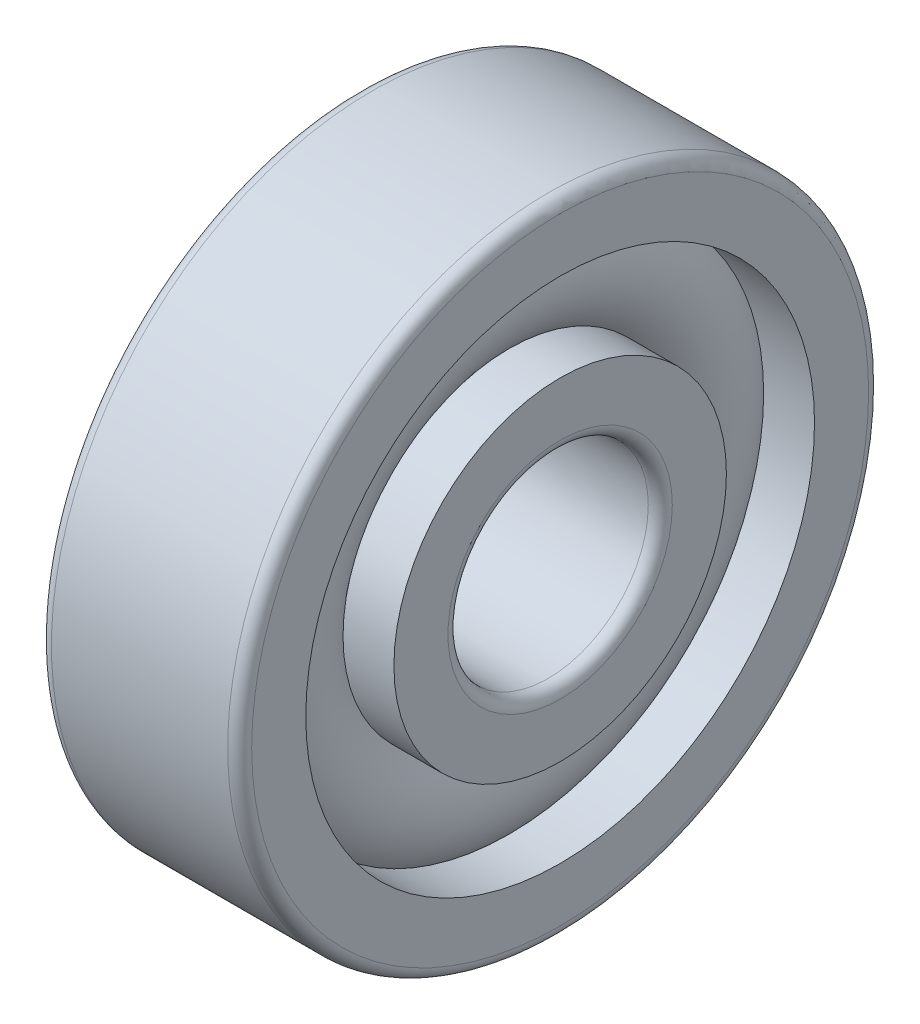
ISO-10303-21;
HEADER;
FILE_DESCRIPTION(('STEP AP214'),'2;1');
FILE_NAME('part.step','',(''),(''),'','','');
FILE_SCHEMA(('AUTOMOTIVE_DESIGN { 1 0 10303 214 1 1 1 1 }'));
ENDSEC;
DATA;
#1=APPLICATION_CONTEXT('core data for automotive mechanical design processes');
#2=APPLICATION_PROTOCOL_DEFINITION('international standard','automotive_design',2000,#1);
#3=PRODUCT_CONTEXT('',#1,'mechanical');
#4=PRODUCT('Part','Part','',(#3));
#5=PRODUCT_RELATED_PRODUCT_CATEGORY('part','',(#4));
#6=PRODUCT_DEFINITION_FORMATION('','',#4);
#7=PRODUCT_DEFINITION_CONTEXT('part definition',#1,'design');
#8=PRODUCT_DEFINITION('design','',#6,#7);
#9=PRODUCT_DEFINITION_SHAPE('','',#8);
#10=(LENGTH_UNIT() NAMED_UNIT(*) SI_UNIT(.MILLI.,.METRE.));
#11=(NAMED_UNIT(*) PLANE_ANGLE_UNIT() SI_UNIT($,.RADIAN.));
#12=(NAMED_UNIT(*) SI_UNIT($,.STERADIAN.) SOLID_ANGLE_UNIT());
#13=UNCERTAINTY_MEASURE_WITH_UNIT(LENGTH_MEASURE(1.E-05),#10,'distance_accuracy_value','');
#14=(GEOMETRIC_REPRESENTATION_CONTEXT(3) GLOBAL_UNCERTAINTY_ASSIGNED_CONTEXT((#13)) GLOBAL_UNIT_ASSIGNED_CONTEXT((#10,
#11,#12)) REPRESENTATION_CONTEXT('',''));
#15=CARTESIAN_POINT('',(0.,0.,0.));
#16=DIRECTION('',(0.,0.,1.));
#17=DIRECTION('',(1.,0.,0.));
#18=AXIS2_PLACEMENT_3D('',#15,#16,#17);
#19=CARTESIAN_POINT('',(0.,0.,0.));
#20=DIRECTION('',(-1.,0.,0.));
#21=DIRECTION('',(0.,0.,1.));
#22=AXIS2_PLACEMENT_3D('',#19,#20,#21);
#23=TOROIDAL_SURFACE('',#22,5.25,1.65);
#24=CARTESIAN_POINT('',(1.22983738762488,0.,0.));
#25=DIRECTION('',(-1.,0.,0.));
#26=DIRECTION('',(0.,0.,1.));
#27=AXIS2_PLACEMENT_3D('',#24,#25,#26);
#28=CIRCLE('',#27,6.35);
#29=CARTESIAN_POINT('',(1.22983738762488,0.,6.35));
#30=VERTEX_POINT('',#29);
#31=EDGE_CURVE('E17',#30,#30,#28,.F.);
#32=ORIENTED_EDGE('',*,*,#31,.T.);
#33=EDGE_LOOP('',(#32));
#34=FACE_BOUND('',#33,.T.);
#35=CARTESIAN_POINT('',(1.22983738762488,0.,0.));
#36=DIRECTION('',(-1.,0.,0.));
#37=DIRECTION('',(0.,0.,1.));
#38=AXIS2_PLACEMENT_3D('',#35,#36,#37);
#39=CIRCLE('',#38,4.15);
#40=CARTESIAN_POINT('',(1.22983738762488,0.,4.15));
#41=VERTEX_POINT('',#40);
#42=EDGE_CURVE('E9',#41,#41,#39,.T.);
#43=ORIENTED_EDGE('',*,*,#42,.T.);
#44=EDGE_LOOP('',(#43));
#45=FACE_BOUND('',#44,.T.);
#46=ADVANCED_FACE('F13',(#34,#45),#23,.T.);
#47=CARTESIAN_POINT('',(-20.6375,0.,0.));
#48=DIRECTION('',(1.,0.,0.));
#49=DIRECTION('',(0.,0.,-1.));
#50=AXIS2_PLACEMENT_3D('',#47,#48,#49);
#51=CYLINDRICAL_SURFACE('',#50,4.15);
#52=CARTESIAN_POINT('',(2.5,0.,0.));
#53=DIRECTION('',(1.,0.,0.));
#54=DIRECTION('',(0.,0.,-1.));
#55=AXIS2_PLACEMENT_3D('',#52,#53,#54);
#56=CIRCLE('',#55,4.15);
#57=CARTESIAN_POINT('',(2.5,0.,-4.15));
#58=VERTEX_POINT('',#57);
#59=EDGE_CURVE('E26',#58,#58,#56,.T.);
#60=ORIENTED_EDGE('',*,*,#59,.F.);
#61=EDGE_LOOP('',(#60));
#62=FACE_BOUND('',#61,.T.);
#63=ORIENTED_EDGE('',*,*,#42,.F.);
#64=EDGE_LOOP('',(#63));
#65=FACE_BOUND('',#64,.T.);
#66=ADVANCED_FACE('F65',(#62,#65),#51,.T.);
#67=CARTESIAN_POINT('',(-20.6375,0.,0.));
#68=DIRECTION('',(1.,0.,0.));
#69=DIRECTION('',(0.,0.,-1.));
#70=AXIS2_PLACEMENT_3D('',#67,#68,#69);
#71=CYLINDRICAL_SURFACE('',#70,4.15);
#72=CARTESIAN_POINT('',(-2.5,0.,0.));
#73=DIRECTION('',(1.,0.,0.));
#74=DIRECTION('',(0.,0.,-1.));
#75=AXIS2_PLACEMENT_3D('',#72,#73,#74);
#76=CIRCLE('',#75,4.15);
#77=CARTESIAN_POINT('',(-2.5,0.,-4.15));
#78=VERTEX_POINT('',#77);
#79=EDGE_CURVE('E35',#78,#78,#76,.T.);
#80=ORIENTED_EDGE('',*,*,#79,.T.);
#81=EDGE_LOOP('',(#80));
#82=FACE_BOUND('',#81,.T.);
#83=CARTESIAN_POINT('',(-1.22983738762488,0.,0.));
#84=DIRECTION('',(1.,0.,0.));
#85=DIRECTION('',(0.,0.,-1.));
#86=AXIS2_PLACEMENT_3D('',#83,#84,#85);
#87=CIRCLE('',#86,4.15);
#88=CARTESIAN_POINT('',(-1.22983738762488,0.,-4.15));
#89=VERTEX_POINT('',#88);
#90=EDGE_CURVE('E21',#89,#89,#87,.T.);
#91=ORIENTED_EDGE('',*,*,#90,.F.);
#92=EDGE_LOOP('',(#91));
#93=FACE_BOUND('',#92,.T.);
#94=ADVANCED_FACE('F68',(#82,#93),#71,.T.);
#95=CARTESIAN_POINT('',(2.5,2.8,0.));
#96=DIRECTION('',(1.,0.,0.));
#97=DIRECTION('',(0.,0.,-1.));
#98=AXIS2_PLACEMENT_3D('',#95,#96,#97);
#99=PLANE('',#98);
#100=ORIENTED_EDGE('',*,*,#59,.T.);
#101=EDGE_LOOP('',(#100));
#102=FACE_BOUND('',#101,.T.);
#103=CARTESIAN_POINT('',(2.5,0.,0.));
#104=DIRECTION('',(1.,0.,0.));
#105=DIRECTION('',(0.,0.,-1.));
#106=AXIS2_PLACEMENT_3D('',#103,#104,#105);
#107=CIRCLE('',#106,2.8);
#108=CARTESIAN_POINT('',(2.5,0.,-2.8));
#109=VERTEX_POINT('',#108);
#110=EDGE_CURVE('E57',#109,#109,#107,.T.);
#111=ORIENTED_EDGE('',*,*,#110,.F.);
#112=EDGE_LOOP('',(#111));
#113=FACE_BOUND('',#112,.T.);
#114=ADVANCED_FACE('F62',(#102,#113),#99,.T.);
#115=CARTESIAN_POINT('',(2.2,0.,0.));
#116=DIRECTION('',(1.,0.,0.));
#117=DIRECTION('',(0.,0.,-1.));
#118=AXIS2_PLACEMENT_3D('',#115,#116,#117);
#119=TOROIDAL_SURFACE('',#118,2.8,0.3);
#120=ORIENTED_EDGE('',*,*,#110,.T.);
#121=EDGE_LOOP('',(#120));
#122=FACE_BOUND('',#121,.T.);
#123=CARTESIAN_POINT('',(2.2,0.,0.));
#124=DIRECTION('',(1.,0.,0.));
#125=DIRECTION('',(0.,0.,-1.));
#126=AXIS2_PLACEMENT_3D('',#123,#124,#125);
#127=CIRCLE('',#126,2.5);
#128=CARTESIAN_POINT('',(2.2,0.,-2.5));
#129=VERTEX_POINT('',#128);
#130=EDGE_CURVE('E54',#129,#129,#127,.T.);
#131=ORIENTED_EDGE('',*,*,#130,.F.);
#132=EDGE_LOOP('',(#131));
#133=FACE_BOUND('',#132,.T.);
#134=ADVANCED_FACE('F81',(#122,#133),#119,.T.);
#135=CARTESIAN_POINT('',(-20.6375,0.,0.));
#136=DIRECTION('',(1.,0.,0.));
#137=DIRECTION('',(0.,0.,-1.));
#138=AXIS2_PLACEMENT_3D('',#135,#136,#137);
#139=CYLINDRICAL_SURFACE('',#138,2.5);
#140=ORIENTED_EDGE('',*,*,#130,.T.);
#141=EDGE_LOOP('',(#140));
#142=FACE_BOUND('',#141,.T.);
#143=CARTESIAN_POINT('',(-2.2,0.,0.));
#144=DIRECTION('',(1.,0.,0.));
#145=DIRECTION('',(0.,0.,-1.));
#146=AXIS2_PLACEMENT_3D('',#143,#144,#145);
#147=CIRCLE('',#146,2.5);
#148=CARTESIAN_POINT('',(-2.2,0.,-2.5));
#149=VERTEX_POINT('',#148);
#150=EDGE_CURVE('E51',#149,#149,#147,.T.);
#151=ORIENTED_EDGE('',*,*,#150,.F.);
#152=EDGE_LOOP('',(#151));
#153=FACE_BOUND('',#152,.T.);
#154=ADVANCED_FACE('F84',(#142,#153),#139,.F.);
#155=CARTESIAN_POINT('',(-2.2,0.,0.));
#156=DIRECTION('',(1.,0.,0.));
#157=DIRECTION('',(0.,0.,-1.));
#158=AXIS2_PLACEMENT_3D('',#155,#156,#157);
#159=TOROIDAL_SURFACE('',#158,2.8,0.3);
#160=ORIENTED_EDGE('',*,*,#150,.T.);
#161=EDGE_LOOP('',(#160));
#162=FACE_BOUND('',#161,.T.);
#163=CARTESIAN_POINT('',(-2.5,0.,0.));
#164=DIRECTION('',(1.,0.,0.));
#165=DIRECTION('',(0.,0.,-1.));
#166=AXIS2_PLACEMENT_3D('',#163,#164,#165);
#167=CIRCLE('',#166,2.8);
#168=CARTESIAN_POINT('',(-2.5,0.,-2.8));
#169=VERTEX_POINT('',#168);
#170=EDGE_CURVE('E48',#169,#169,#167,.T.);
#171=ORIENTED_EDGE('',*,*,#170,.F.);
#172=EDGE_LOOP('',(#171));
#173=FACE_BOUND('',#172,.T.);
#174=ADVANCED_FACE('F88',(#162,#173),#159,.T.);
#175=CARTESIAN_POINT('',(-2.5,4.15,0.));
#176=DIRECTION('',(-1.,0.,0.));
#177=DIRECTION('',(0.,0.,1.));
#178=AXIS2_PLACEMENT_3D('',#175,#176,#177);
#179=PLANE('',#178);
#180=ORIENTED_EDGE('',*,*,#170,.T.);
#181=EDGE_LOOP('',(#180));
#182=FACE_BOUND('',#181,.T.);
#183=ORIENTED_EDGE('',*,*,#79,.F.);
#184=EDGE_LOOP('',(#183));
#185=FACE_BOUND('',#184,.T.);
#186=ADVANCED_FACE('F92',(#182,#185),#179,.T.);
#187=CARTESIAN_POINT('',(-1.22983738762488,0.,0.));
#188=DIRECTION('',(1.,0.,0.));
#189=DIRECTION('',(0.,0.,-1.));
#190=AXIS2_PLACEMENT_3D('',#187,#188,#189);
#191=CIRCLE('',#190,6.35);
#192=CARTESIAN_POINT('',(-1.22983738762488,0.,-6.35));
#193=VERTEX_POINT('',#192);
#194=EDGE_CURVE('E29',#193,#193,#191,.F.);
#195=ORIENTED_EDGE('',*,*,#194,.T.);
#196=EDGE_LOOP('',(#195));
#197=FACE_BOUND('',#196,.T.);
#198=ORIENTED_EDGE('',*,*,#90,.T.);
#199=EDGE_LOOP('',(#198));
#200=FACE_BOUND('',#199,.T.);
#201=ADVANCED_FACE('F15',(#197,#200),#23,.T.);
#202=CARTESIAN_POINT('',(-20.6375,0.,0.));
#203=DIRECTION('',(1.,0.,0.));
#204=DIRECTION('',(0.,0.,-1.));
#205=AXIS2_PLACEMENT_3D('',#202,#203,#204);
#206=CYLINDRICAL_SURFACE('',#205,6.35);
#207=CARTESIAN_POINT('',(2.5,0.,0.));
#208=DIRECTION('',(1.,0.,0.));
#209=DIRECTION('',(0.,0.,-1.));
#210=AXIS2_PLACEMENT_3D('',#207,#208,#209);
#211=CIRCLE('',#210,6.35);
#212=CARTESIAN_POINT('',(2.5,0.,-6.35));
#213=VERTEX_POINT('',#212);
#214=EDGE_CURVE('E31',#213,#213,#211,.T.);
#215=ORIENTED_EDGE('',*,*,#214,.T.);
#216=EDGE_LOOP('',(#215));
#217=FACE_BOUND('',#216,.T.);
#218=ORIENTED_EDGE('',*,*,#31,.F.);
#219=EDGE_LOOP('',(#218));
#220=FACE_BOUND('',#219,.T.);
#221=ADVANCED_FACE('F97',(#217,#220),#206,.F.);
#222=CARTESIAN_POINT('',(-20.6375,0.,0.));
#223=DIRECTION('',(1.,0.,0.));
#224=DIRECTION('',(0.,0.,-1.));
#225=AXIS2_PLACEMENT_3D('',#222,#223,#224);
#226=CYLINDRICAL_SURFACE('',#225,6.35);
#227=CARTESIAN_POINT('',(-2.5,0.,0.));
#228=DIRECTION('',(1.,0.,0.));
#229=DIRECTION('',(0.,0.,-1.));
#230=AXIS2_PLACEMENT_3D('',#227,#228,#229);
#231=CIRCLE('',#230,6.35);
#232=CARTESIAN_POINT('',(-2.5,0.,-6.35));
#233=VERTEX_POINT('',#232);
#234=EDGE_CURVE('E129',#233,#233,#231,.T.);
#235=ORIENTED_EDGE('',*,*,#234,.F.);
#236=EDGE_LOOP('',(#235));
#237=FACE_BOUND('',#236,.T.);
#238=ORIENTED_EDGE('',*,*,#194,.F.);
#239=EDGE_LOOP('',(#238));
#240=FACE_BOUND('',#239,.T.);
#241=ADVANCED_FACE('F100',(#237,#240),#226,.F.);
#242=CARTESIAN_POINT('',(2.5,7.7,0.));
#243=DIRECTION('',(1.,0.,0.));
#244=DIRECTION('',(0.,0.,-1.));
#245=AXIS2_PLACEMENT_3D('',#242,#243,#244);
#246=PLANE('',#245);
#247=CARTESIAN_POINT('',(2.5,0.,0.));
#248=DIRECTION('',(1.,0.,0.));
#249=DIRECTION('',(0.,0.,-1.));
#250=AXIS2_PLACEMENT_3D('',#247,#248,#249);
#251=CIRCLE('',#250,7.7);
#252=CARTESIAN_POINT('',(2.5,0.,-7.7));
#253=VERTEX_POINT('',#252);
#254=EDGE_CURVE('E37',#253,#253,#251,.T.);
#255=ORIENTED_EDGE('',*,*,#254,.T.);
#256=EDGE_LOOP('',(#255));
#257=FACE_BOUND('',#256,.T.);
#258=ORIENTED_EDGE('',*,*,#214,.F.);
#259=EDGE_LOOP('',(#258));
#260=FACE_BOUND('',#259,.T.);
#261=ADVANCED_FACE('F101',(#257,#260),#246,.T.);
#262=CARTESIAN_POINT('',(2.2,0.,0.));
#263=DIRECTION('',(1.,0.,0.));
#264=DIRECTION('',(0.,0.,-1.));
#265=AXIS2_PLACEMENT_3D('',#262,#263,#264);
#266=TOROIDAL_SURFACE('',#265,7.7,0.3);
#267=CARTESIAN_POINT('',(2.2,0.,0.));
#268=DIRECTION('',(1.,0.,0.));
#269=DIRECTION('',(0.,0.,-1.));
#270=AXIS2_PLACEMENT_3D('',#267,#268,#269);
#271=CIRCLE('',#270,8.);
#272=CARTESIAN_POINT('',(2.2,0.,-8.));
#273=VERTEX_POINT('',#272);
#274=EDGE_CURVE('E42',#273,#273,#271,.T.);
#275=ORIENTED_EDGE('',*,*,#274,.T.);
#276=EDGE_LOOP('',(#275));
#277=FACE_BOUND('',#276,.T.);
#278=ORIENTED_EDGE('',*,*,#254,.F.);
#279=EDGE_LOOP('',(#278));
#280=FACE_BOUND('',#279,.T.);
#281=ADVANCED_FACE('F104',(#277,#280),#266,.T.);
#282=CARTESIAN_POINT('',(-20.6375,0.,0.));
#283=DIRECTION('',(1.,0.,0.));
#284=DIRECTION('',(0.,0.,-1.));
#285=AXIS2_PLACEMENT_3D('',#282,#283,#284);
#286=CYLINDRICAL_SURFACE('',#285,8.);
#287=CARTESIAN_POINT('',(-2.2,0.,0.));
#288=DIRECTION('',(1.,0.,0.));
#289=DIRECTION('',(0.,0.,-1.));
#290=AXIS2_PLACEMENT_3D('',#287,#288,#289);
#291=CIRCLE('',#290,8.);
#292=CARTESIAN_POINT('',(-2.2,0.,-8.));
#293=VERTEX_POINT('',#292);
#294=EDGE_CURVE('E133',#293,#293,#291,.T.);
#295=ORIENTED_EDGE('',*,*,#294,.T.);
#296=EDGE_LOOP('',(#295));
#297=FACE_BOUND('',#296,.T.);
#298=ORIENTED_EDGE('',*,*,#274,.F.);
#299=EDGE_LOOP('',(#298));
#300=FACE_BOUND('',#299,.T.);
#301=ADVANCED_FACE('F108',(#297,#300),#286,.T.);
#302=CARTESIAN_POINT('',(-2.2,0.,0.));
#303=DIRECTION('',(1.,0.,0.));
#304=DIRECTION('',(0.,0.,-1.));
#305=AXIS2_PLACEMENT_3D('',#302,#303,#304);
#306=TOROIDAL_SURFACE('',#305,7.7,0.3);
#307=CARTESIAN_POINT('',(-2.5,0.,0.));
#308=DIRECTION('',(1.,0.,0.));
#309=DIRECTION('',(0.,0.,-1.));
#310=AXIS2_PLACEMENT_3D('',#307,#308,#309);
#311=CIRCLE('',#310,7.7);
#312=CARTESIAN_POINT('',(-2.5,0.,-7.7));
#313=VERTEX_POINT('',#312);
#314=EDGE_CURVE('E130',#313,#313,#311,.T.);
#315=ORIENTED_EDGE('',*,*,#314,.T.);
#316=EDGE_LOOP('',(#315));
#317=FACE_BOUND('',#316,.T.);
#318=ORIENTED_EDGE('',*,*,#294,.F.);
#319=EDGE_LOOP('',(#318));
#320=FACE_BOUND('',#319,.T.);
#321=ADVANCED_FACE('F112',(#317,#320),#306,.T.);
#322=CARTESIAN_POINT('',(-2.5,6.35,0.));
#323=DIRECTION('',(-1.,0.,0.));
#324=DIRECTION('',(0.,0.,1.));
#325=AXIS2_PLACEMENT_3D('',#322,#323,#324);
#326=PLANE('',#325);
#327=ORIENTED_EDGE('',*,*,#234,.T.);
#328=EDGE_LOOP('',(#327));
#329=FACE_BOUND('',#328,.T.);
#330=ORIENTED_EDGE('',*,*,#314,.F.);
#331=EDGE_LOOP('',(#330));
#332=FACE_BOUND('',#331,.T.);
#333=ADVANCED_FACE('F116',(#329,#332),#326,.T.);
#334=CLOSED_SHELL('',(#46,#66,#94,#114,#134,#154,#174,#186,#201,#221,#241,#261,#281,#301,#321,#333));
#335=MANIFOLD_SOLID_BREP('B1',#334);
#336=ADVANCED_BREP_SHAPE_REPRESENTATION('',(#18,#335),#14);
#337=SHAPE_DEFINITION_REPRESENTATION(#9,#336);
ENDSEC;
END-ISO-10303-21;
